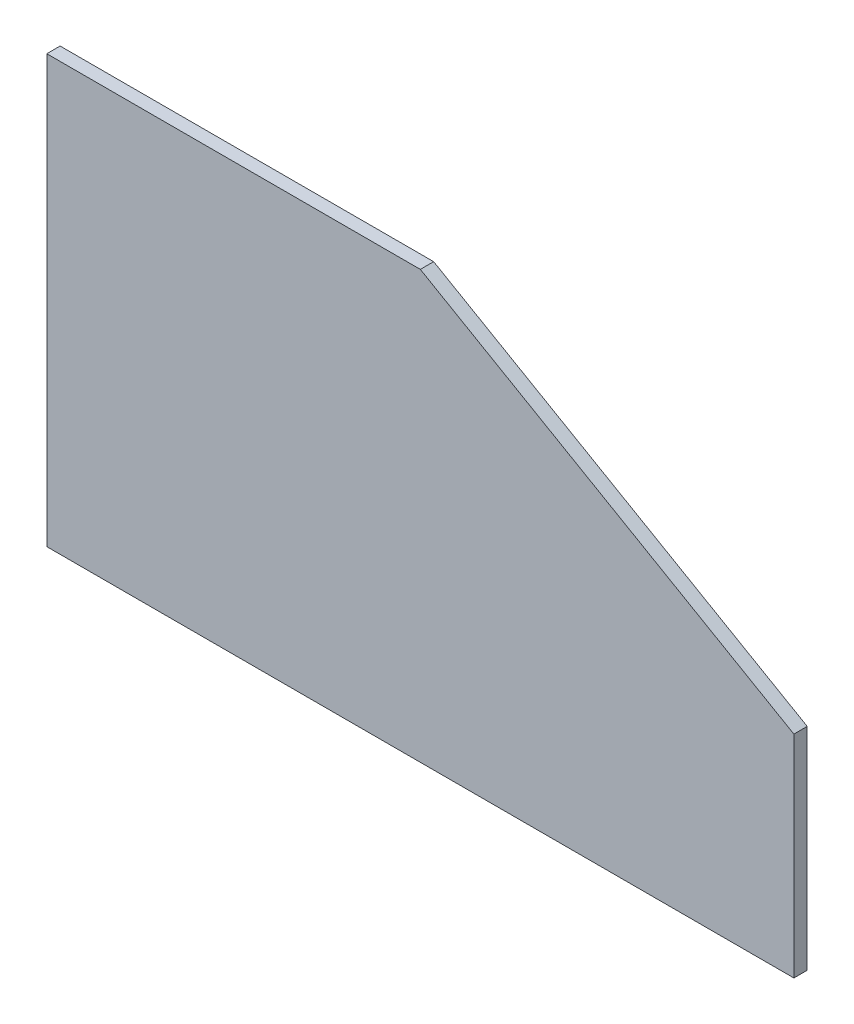
ISO-10303-21;
HEADER;
FILE_DESCRIPTION(('STEP AP214'),'2;1');
FILE_NAME('part.step','',(''),(''),'','','');
FILE_SCHEMA(('AUTOMOTIVE_DESIGN { 1 0 10303 214 1 1 1 1 }'));
ENDSEC;
DATA;
#1=APPLICATION_CONTEXT('core data for automotive mechanical design processes');
#2=APPLICATION_PROTOCOL_DEFINITION('international standard','automotive_design',2000,#1);
#3=PRODUCT_CONTEXT('',#1,'mechanical');
#4=PRODUCT('Part','Part','',(#3));
#5=PRODUCT_RELATED_PRODUCT_CATEGORY('part','',(#4));
#6=PRODUCT_DEFINITION_FORMATION('','',#4);
#7=PRODUCT_DEFINITION_CONTEXT('part definition',#1,'design');
#8=PRODUCT_DEFINITION('design','',#6,#7);
#9=PRODUCT_DEFINITION_SHAPE('','',#8);
#10=(LENGTH_UNIT() NAMED_UNIT(*) SI_UNIT(.MILLI.,.METRE.));
#11=(NAMED_UNIT(*) PLANE_ANGLE_UNIT() SI_UNIT($,.RADIAN.));
#12=(NAMED_UNIT(*) SI_UNIT($,.STERADIAN.) SOLID_ANGLE_UNIT());
#13=UNCERTAINTY_MEASURE_WITH_UNIT(LENGTH_MEASURE(1.E-05),#10,'distance_accuracy_value','');
#14=(GEOMETRIC_REPRESENTATION_CONTEXT(3) GLOBAL_UNCERTAINTY_ASSIGNED_CONTEXT((#13)) GLOBAL_UNIT_ASSIGNED_CONTEXT((#10,
#11,#12)) REPRESENTATION_CONTEXT('',''));
#15=CARTESIAN_POINT('',(0.,0.,0.));
#16=DIRECTION('',(0.,0.,1.));
#17=DIRECTION('',(1.,0.,0.));
#18=AXIS2_PLACEMENT_3D('',#15,#16,#17);
#19=CARTESIAN_POINT('',(355.6,0.,6.35));
#20=DIRECTION('',(0.,1.,0.));
#21=DIRECTION('',(-1.,0.,0.));
#22=AXIS2_PLACEMENT_3D('',#19,#20,#21);
#23=PLANE('',#22);
#24=DIRECTION('',(1.,0.,0.));
#25=VECTOR('',#24,1.);
#26=CARTESIAN_POINT('',(355.6,0.,0.));
#27=LINE('',#26,#25);
#28=CARTESIAN_POINT('',(0.,0.,0.));
#29=VERTEX_POINT('',#28);
#30=CARTESIAN_POINT('',(355.6,0.,0.));
#31=VERTEX_POINT('',#30);
#32=EDGE_CURVE('E107',#29,#31,#27,.T.);
#33=ORIENTED_EDGE('',*,*,#32,.T.);
#34=DIRECTION('',(0.,0.,-1.));
#35=VECTOR('',#34,1.);
#36=CARTESIAN_POINT('',(355.6,0.,6.35));
#37=LINE('',#36,#35);
#38=CARTESIAN_POINT('',(355.6,0.,6.35));
#39=VERTEX_POINT('',#38);
#40=EDGE_CURVE('E11',#39,#31,#37,.T.);
#41=ORIENTED_EDGE('',*,*,#40,.F.);
#42=DIRECTION('',(1.,0.,0.));
#43=VECTOR('',#42,1.);
#44=CARTESIAN_POINT('',(355.6,0.,6.35));
#45=LINE('',#44,#43);
#46=CARTESIAN_POINT('',(0.,0.,6.35));
#47=VERTEX_POINT('',#46);
#48=EDGE_CURVE('E115',#47,#39,#45,.T.);
#49=ORIENTED_EDGE('',*,*,#48,.F.);
#50=DIRECTION('',(0.,0.,-1.));
#51=VECTOR('',#50,1.);
#52=CARTESIAN_POINT('',(0.,0.,6.35));
#53=LINE('',#52,#51);
#54=EDGE_CURVE('E103',#47,#29,#53,.T.);
#55=ORIENTED_EDGE('',*,*,#54,.T.);
#56=EDGE_LOOP('',(#33,#41,#49,#55));
#57=FACE_BOUND('',#56,.T.);
#58=ADVANCED_FACE('F33',(#57),#23,.F.);
#59=CARTESIAN_POINT('',(355.6,100.547122138084,6.35));
#60=DIRECTION('',(-1.,0.,0.));
#61=DIRECTION('',(0.,0.,1.));
#62=AXIS2_PLACEMENT_3D('',#59,#60,#61);
#63=PLANE('',#62);
#64=DIRECTION('',(0.,1.,0.));
#65=VECTOR('',#64,1.);
#66=CARTESIAN_POINT('',(355.6,100.547122138084,0.));
#67=LINE('',#66,#65);
#68=CARTESIAN_POINT('',(355.6,100.547122138084,0.));
#69=VERTEX_POINT('',#68);
#70=EDGE_CURVE('E110',#31,#69,#67,.T.);
#71=ORIENTED_EDGE('',*,*,#70,.T.);
#72=DIRECTION('',(0.,0.,-1.));
#73=VECTOR('',#72,1.);
#74=CARTESIAN_POINT('',(355.6,100.547122138084,6.35));
#75=LINE('',#74,#73);
#76=CARTESIAN_POINT('',(355.6,100.547122138084,6.35));
#77=VERTEX_POINT('',#76);
#78=EDGE_CURVE('E41',#77,#69,#75,.T.);
#79=ORIENTED_EDGE('',*,*,#78,.F.);
#80=DIRECTION('',(0.,1.,0.));
#81=VECTOR('',#80,1.);
#82=CARTESIAN_POINT('',(355.6,100.547122138084,6.35));
#83=LINE('',#82,#81);
#84=EDGE_CURVE('E83',#39,#77,#83,.T.);
#85=ORIENTED_EDGE('',*,*,#84,.F.);
#86=ORIENTED_EDGE('',*,*,#40,.T.);
#87=EDGE_LOOP('',(#71,#79,#85,#86));
#88=FACE_BOUND('',#87,.T.);
#89=ADVANCED_FACE('F134',(#88),#63,.F.);
#90=CARTESIAN_POINT('',(177.8,203.2,6.35));
#91=DIRECTION('',(-0.500000000000001,-0.866025403784438,0.));
#92=DIRECTION('',(0.866025403784438,-0.500000000000001,0.));
#93=AXIS2_PLACEMENT_3D('',#90,#91,#92);
#94=PLANE('',#93);
#95=DIRECTION('',(-0.866025403784438,0.500000000000001,0.));
#96=VECTOR('',#95,1.);
#97=CARTESIAN_POINT('',(177.8,203.2,0.));
#98=LINE('',#97,#96);
#99=CARTESIAN_POINT('',(177.8,203.2,0.));
#100=VERTEX_POINT('',#99);
#101=EDGE_CURVE('E98',#69,#100,#98,.T.);
#102=ORIENTED_EDGE('',*,*,#101,.T.);
#103=DIRECTION('',(0.,0.,-1.));
#104=VECTOR('',#103,1.);
#105=CARTESIAN_POINT('',(177.8,203.2,6.35));
#106=LINE('',#105,#104);
#107=CARTESIAN_POINT('',(177.8,203.2,6.35));
#108=VERTEX_POINT('',#107);
#109=EDGE_CURVE('E95',#108,#100,#106,.T.);
#110=ORIENTED_EDGE('',*,*,#109,.F.);
#111=DIRECTION('',(-0.866025403784438,0.500000000000001,0.));
#112=VECTOR('',#111,1.);
#113=CARTESIAN_POINT('',(177.8,203.2,6.35));
#114=LINE('',#113,#112);
#115=EDGE_CURVE('E87',#77,#108,#114,.T.);
#116=ORIENTED_EDGE('',*,*,#115,.F.);
#117=ORIENTED_EDGE('',*,*,#78,.T.);
#118=EDGE_LOOP('',(#102,#110,#116,#117));
#119=FACE_BOUND('',#118,.T.);
#120=ADVANCED_FACE('F96',(#119),#94,.F.);
#121=CARTESIAN_POINT('',(0.,203.2,6.35));
#122=DIRECTION('',(0.,-1.,0.));
#123=DIRECTION('',(0.,0.,-1.));
#124=AXIS2_PLACEMENT_3D('',#121,#122,#123);
#125=PLANE('',#124);
#126=DIRECTION('',(-1.,0.,0.));
#127=VECTOR('',#126,1.);
#128=CARTESIAN_POINT('',(0.,203.2,0.));
#129=LINE('',#128,#127);
#130=CARTESIAN_POINT('',(0.,203.2,0.));
#131=VERTEX_POINT('',#130);
#132=EDGE_CURVE('E69',#100,#131,#129,.T.);
#133=ORIENTED_EDGE('',*,*,#132,.T.);
#134=DIRECTION('',(0.,0.,-1.));
#135=VECTOR('',#134,1.);
#136=CARTESIAN_POINT('',(0.,203.2,6.35));
#137=LINE('',#136,#135);
#138=CARTESIAN_POINT('',(0.,203.2,6.35));
#139=VERTEX_POINT('',#138);
#140=EDGE_CURVE('E99',#139,#131,#137,.T.);
#141=ORIENTED_EDGE('',*,*,#140,.F.);
#142=DIRECTION('',(-1.,0.,0.));
#143=VECTOR('',#142,1.);
#144=CARTESIAN_POINT('',(0.,203.2,6.35));
#145=LINE('',#144,#143);
#146=EDGE_CURVE('E91',#108,#139,#145,.T.);
#147=ORIENTED_EDGE('',*,*,#146,.F.);
#148=ORIENTED_EDGE('',*,*,#109,.T.);
#149=EDGE_LOOP('',(#133,#141,#147,#148));
#150=FACE_BOUND('',#149,.T.);
#151=ADVANCED_FACE('F101',(#150),#125,.F.);
#152=CARTESIAN_POINT('',(0.,0.,6.35));
#153=DIRECTION('',(1.,0.,0.));
#154=DIRECTION('',(0.,0.,-1.));
#155=AXIS2_PLACEMENT_3D('',#152,#153,#154);
#156=PLANE('',#155);
#157=DIRECTION('',(0.,-1.,0.));
#158=VECTOR('',#157,1.);
#159=CARTESIAN_POINT('',(0.,0.,0.));
#160=LINE('',#159,#158);
#161=EDGE_CURVE('E75',#131,#29,#160,.T.);
#162=ORIENTED_EDGE('',*,*,#161,.T.);
#163=ORIENTED_EDGE('',*,*,#54,.F.);
#164=DIRECTION('',(0.,-1.,0.));
#165=VECTOR('',#164,1.);
#166=CARTESIAN_POINT('',(0.,0.,6.35));
#167=LINE('',#166,#165);
#168=EDGE_CURVE('E49',#139,#47,#167,.T.);
#169=ORIENTED_EDGE('',*,*,#168,.F.);
#170=ORIENTED_EDGE('',*,*,#140,.T.);
#171=EDGE_LOOP('',(#162,#163,#169,#170));
#172=FACE_BOUND('',#171,.T.);
#173=ADVANCED_FACE('F123',(#172),#156,.F.);
#174=CARTESIAN_POINT('',(0.,0.,6.35));
#175=DIRECTION('',(0.,0.,-1.));
#176=DIRECTION('',(-1.,0.,0.));
#177=AXIS2_PLACEMENT_3D('',#174,#175,#176);
#178=PLANE('',#177);
#179=ORIENTED_EDGE('',*,*,#48,.T.);
#180=ORIENTED_EDGE('',*,*,#84,.T.);
#181=ORIENTED_EDGE('',*,*,#115,.T.);
#182=ORIENTED_EDGE('',*,*,#146,.T.);
#183=ORIENTED_EDGE('',*,*,#168,.T.);
#184=EDGE_LOOP('',(#179,#180,#181,#182,#183));
#185=FACE_BOUND('',#184,.T.);
#186=ADVANCED_FACE('F89',(#185),#178,.F.);
#187=CARTESIAN_POINT('',(0.,0.,0.));
#188=DIRECTION('',(0.,0.,-1.));
#189=DIRECTION('',(-1.,0.,0.));
#190=AXIS2_PLACEMENT_3D('',#187,#188,#189);
#191=PLANE('',#190);
#192=ORIENTED_EDGE('',*,*,#32,.F.);
#193=ORIENTED_EDGE('',*,*,#161,.F.);
#194=ORIENTED_EDGE('',*,*,#132,.F.);
#195=ORIENTED_EDGE('',*,*,#101,.F.);
#196=ORIENTED_EDGE('',*,*,#70,.F.);
#197=EDGE_LOOP('',(#192,#193,#194,#195,#196));
#198=FACE_BOUND('',#197,.T.);
#199=ADVANCED_FACE('F119',(#198),#191,.T.);
#200=CLOSED_SHELL('',(#58,#89,#120,#151,#173,#186,#199));
#201=MANIFOLD_SOLID_BREP('B2',#200);
#202=ADVANCED_BREP_SHAPE_REPRESENTATION('',(#18,#201),#14);
#203=SHAPE_DEFINITION_REPRESENTATION(#9,#202);
ENDSEC;
END-ISO-10303-21;
